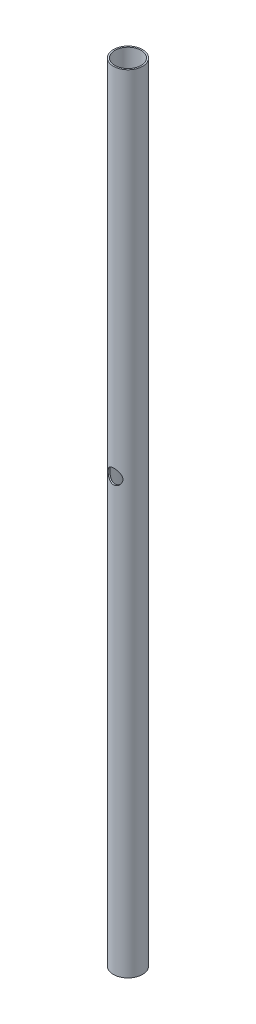
ISO-10303-21;
HEADER;
FILE_DESCRIPTION(('STEP AP214'),'2;1');
FILE_NAME('part.step','',(''),(''),'','','');
FILE_SCHEMA(('AUTOMOTIVE_DESIGN { 1 0 10303 214 1 1 1 1 }'));
ENDSEC;
DATA;
#1=APPLICATION_CONTEXT('core data for automotive mechanical design processes');
#2=APPLICATION_PROTOCOL_DEFINITION('international standard','automotive_design',2000,#1);
#3=PRODUCT_CONTEXT('',#1,'mechanical');
#4=PRODUCT('Part','Part','',(#3));
#5=PRODUCT_RELATED_PRODUCT_CATEGORY('part','',(#4));
#6=PRODUCT_DEFINITION_FORMATION('','',#4);
#7=PRODUCT_DEFINITION_CONTEXT('part definition',#1,'design');
#8=PRODUCT_DEFINITION('design','',#6,#7);
#9=PRODUCT_DEFINITION_SHAPE('','',#8);
#10=(LENGTH_UNIT() NAMED_UNIT(*) SI_UNIT(.MILLI.,.METRE.));
#11=(NAMED_UNIT(*) PLANE_ANGLE_UNIT() SI_UNIT($,.RADIAN.));
#12=(NAMED_UNIT(*) SI_UNIT($,.STERADIAN.) SOLID_ANGLE_UNIT());
#13=UNCERTAINTY_MEASURE_WITH_UNIT(LENGTH_MEASURE(1.E-05),#10,'distance_accuracy_value','');
#14=(GEOMETRIC_REPRESENTATION_CONTEXT(3) GLOBAL_UNCERTAINTY_ASSIGNED_CONTEXT((#13)) GLOBAL_UNIT_ASSIGNED_CONTEXT((#10,
#11,#12)) REPRESENTATION_CONTEXT('',''));
#15=CARTESIAN_POINT('',(0.,0.,0.));
#16=DIRECTION('',(0.,0.,1.));
#17=DIRECTION('',(1.,0.,0.));
#18=AXIS2_PLACEMENT_3D('',#15,#16,#17);
#19=CARTESIAN_POINT('',(0.,27.,0.));
#20=DIRECTION('',(0.,1.,0.));
#21=DIRECTION('',(0.,0.,1.));
#22=AXIS2_PLACEMENT_3D('',#19,#20,#21);
#23=PLANE('',#22);
#24=CARTESIAN_POINT('',(0.,27.,0.));
#25=DIRECTION('',(0.,1.,0.));
#26=DIRECTION('',(0.,0.,1.));
#27=AXIS2_PLACEMENT_3D('',#24,#25,#26);
#28=CIRCLE('',#27,0.5);
#29=CARTESIAN_POINT('',(0.,27.,0.5));
#30=VERTEX_POINT('',#29);
#31=EDGE_CURVE('E10',#30,#30,#28,.T.);
#32=ORIENTED_EDGE('',*,*,#31,.T.);
#33=EDGE_LOOP('',(#32));
#34=FACE_BOUND('',#33,.T.);
#35=CARTESIAN_POINT('',(0.,27.,0.));
#36=DIRECTION('',(0.,1.,0.));
#37=DIRECTION('',(0.,0.,1.));
#38=AXIS2_PLACEMENT_3D('',#35,#36,#37);
#39=CIRCLE('',#38,0.45);
#40=CARTESIAN_POINT('',(0.,27.,0.45));
#41=VERTEX_POINT('',#40);
#42=EDGE_CURVE('E51',#41,#41,#39,.T.);
#43=ORIENTED_EDGE('',*,*,#42,.F.);
#44=EDGE_LOOP('',(#43));
#45=FACE_BOUND('',#44,.T.);
#46=ADVANCED_FACE('F33',(#34,#45),#23,.T.);
#47=CARTESIAN_POINT('',(0.,0.,0.));
#48=DIRECTION('',(0.,1.,0.));
#49=DIRECTION('',(0.,0.,1.));
#50=AXIS2_PLACEMENT_3D('',#47,#48,#49);
#51=PLANE('',#50);
#52=CARTESIAN_POINT('',(0.,0.,0.));
#53=DIRECTION('',(0.,1.,0.));
#54=DIRECTION('',(0.,0.,1.));
#55=AXIS2_PLACEMENT_3D('',#52,#53,#54);
#56=CIRCLE('',#55,0.5);
#57=CARTESIAN_POINT('',(0.,0.,0.5));
#58=VERTEX_POINT('',#57);
#59=EDGE_CURVE('E46',#58,#58,#56,.T.);
#60=ORIENTED_EDGE('',*,*,#59,.F.);
#61=EDGE_LOOP('',(#60));
#62=FACE_BOUND('',#61,.T.);
#63=CARTESIAN_POINT('',(0.,0.,0.));
#64=DIRECTION('',(0.,1.,0.));
#65=DIRECTION('',(0.,0.,1.));
#66=AXIS2_PLACEMENT_3D('',#63,#64,#65);
#67=CIRCLE('',#66,0.45);
#68=CARTESIAN_POINT('',(0.,0.,0.45));
#69=VERTEX_POINT('',#68);
#70=EDGE_CURVE('E54',#69,#69,#67,.T.);
#71=ORIENTED_EDGE('',*,*,#70,.T.);
#72=EDGE_LOOP('',(#71));
#73=FACE_BOUND('',#72,.T.);
#74=ADVANCED_FACE('F87',(#62,#73),#51,.F.);
#75=CARTESIAN_POINT('',(0.,27.,0.));
#76=DIRECTION('',(0.,-1.,0.));
#77=DIRECTION('',(0.,0.,-1.));
#78=AXIS2_PLACEMENT_3D('',#75,#76,#77);
#79=CYLINDRICAL_SURFACE('',#78,0.5);
#80=CARTESIAN_POINT('',(0.,15.0599260781396,-0.5));
#81=CARTESIAN_POINT('',(-0.0130687405971079,15.0602431086734,-0.499999284397319));
#82=CARTESIAN_POINT('',(-0.0261776018533731,15.0595314674071,-0.499482183346041));
#83=CARTESIAN_POINT('',(-0.0520590129046771,15.0560787456185,-0.497452636192285));
#84=CARTESIAN_POINT('',(-0.0648309223805699,15.053334054152,-0.49593841962325));
#85=CARTESIAN_POINT('',(-0.0896239120042474,15.0459501821895,-0.49206143155771));
#86=CARTESIAN_POINT('',(-0.101647532498621,15.0413178658077,-0.489701738246784));
#87=CARTESIAN_POINT('',(-0.12471712373678,15.0303318529036,-0.484340890382829));
#88=CARTESIAN_POINT('',(-0.135763151760689,15.0239782573249,-0.481339773448));
#89=CARTESIAN_POINT('',(-0.157275681558225,15.0093238905417,-0.474760969070735));
#90=CARTESIAN_POINT('',(-0.167673611030449,15.000933005914,-0.471160212425725));
#91=CARTESIAN_POINT('',(-0.186981585823429,14.9826214165534,-0.463836948870498));
#92=CARTESIAN_POINT('',(-0.19589052768106,14.9726995876444,-0.460114354089743));
#93=CARTESIAN_POINT('',(-0.212731477233477,14.9506137933225,-0.452589658046664));
#94=CARTESIAN_POINT('',(-0.220518037368855,14.9383313756371,-0.448807260495963));
#95=CARTESIAN_POINT('',(-0.233905777593569,14.9124382860135,-0.441978345828607));
#96=CARTESIAN_POINT('',(-0.239508047766033,14.8988282808666,-0.438931461939311));
#97=CARTESIAN_POINT('',(-0.248076109685941,14.8712894195727,-0.434144545782209));
#98=CARTESIAN_POINT('',(-0.251152512968562,14.8574049147717,-0.432350270726179));
#99=CARTESIAN_POINT('',(-0.254913315477513,14.8292140818069,-0.430144585100165));
#100=CARTESIAN_POINT('',(-0.255600464716143,14.8149082577257,-0.429731584714976));
#101=CARTESIAN_POINT('',(-0.254611220001515,14.7881919769786,-0.430317341582915));
#102=CARTESIAN_POINT('',(-0.253216764385989,14.7757660285644,-0.43114773471273));
#103=CARTESIAN_POINT('',(-0.248635294144277,14.7513598579255,-0.433805739197923));
#104=CARTESIAN_POINT('',(-0.245447741774136,14.7393797705627,-0.435633649700639));
#105=CARTESIAN_POINT('',(-0.237378497741717,14.7160583735207,-0.440082526015176));
#106=CARTESIAN_POINT('',(-0.232483606885439,14.704722865132,-0.442709649591787));
#107=CARTESIAN_POINT('',(-0.221153671196261,14.6829927528248,-0.448476761823108));
#108=CARTESIAN_POINT('',(-0.214717993430506,14.6725985380007,-0.45161696107307));
#109=CARTESIAN_POINT('',(-0.199547388299089,14.6516698856591,-0.458539688367242));
#110=CARTESIAN_POINT('',(-0.190625434188534,14.6412809660477,-0.462353404796399));
#111=CARTESIAN_POINT('',(-0.171180155602426,14.6220836764971,-0.469900163352473));
#112=CARTESIAN_POINT('',(-0.160655960127447,14.6132761719459,-0.473633160331017));
#113=CARTESIAN_POINT('',(-0.137535812208262,14.59699057975,-0.480873056799112));
#114=CARTESIAN_POINT('',(-0.124854439719656,14.5896210778275,-0.484353765100492));
#115=CARTESIAN_POINT('',(-0.0982202352461421,14.5771771172148,-0.490447594237901));
#116=CARTESIAN_POINT('',(-0.0842683228424406,14.5721010142424,-0.493061336298128));
#117=CARTESIAN_POINT('',(-0.0566087674253749,14.5647797816459,-0.496966359714166));
#118=CARTESIAN_POINT('',(-0.0429622526949473,14.5623498028946,-0.498342608405552));
#119=CARTESIAN_POINT('',(-0.0153912241485817,14.5597902962006,-0.499953375844379));
#120=CARTESIAN_POINT('',(-0.00146686832960867,14.5596594961443,-0.500188525898676));
#121=CARTESIAN_POINT('',(0.0250154405869219,14.5616154303193,-0.499534805532417));
#122=CARTESIAN_POINT('',(0.0375900062404483,14.5635170066196,-0.498738598759838));
#123=CARTESIAN_POINT('',(0.0622251223147617,14.5691666499727,-0.496267401288213));
#124=CARTESIAN_POINT('',(0.0742856281507444,14.5729148768343,-0.494592334531973));
#125=CARTESIAN_POINT('',(0.0978262976398352,14.5822022385959,-0.490485094588233));
#126=CARTESIAN_POINT('',(0.109291023999279,14.5877741379572,-0.488039103084186));
#127=CARTESIAN_POINT('',(0.131160676953078,14.6005114978656,-0.482622001350253));
#128=CARTESIAN_POINT('',(0.141565197808523,14.6076775651835,-0.479650691262711));
#129=CARTESIAN_POINT('',(0.162081052561194,14.6241918003976,-0.473134658613066));
#130=CARTESIAN_POINT('',(0.172068241865524,14.6336834463642,-0.469562271913127));
#131=CARTESIAN_POINT('',(0.190372307490366,14.6541803463061,-0.462444621157885));
#132=CARTESIAN_POINT('',(0.198687931339629,14.6651867249158,-0.458899379340722));
#133=CARTESIAN_POINT('',(0.213880685542216,14.6891963253733,-0.452027275527825));
#134=CARTESIAN_POINT('',(0.220645142265048,14.7022787146691,-0.448725338160548));
#135=CARTESIAN_POINT('',(0.231807767227097,14.7296034700236,-0.443062957206013));
#136=CARTESIAN_POINT('',(0.236208628749406,14.7438444944266,-0.440701442817151));
#137=CARTESIAN_POINT('',(0.24213886158658,14.7717942034951,-0.437469235890071));
#138=CARTESIAN_POINT('',(0.243881351049397,14.7854444976997,-0.436488455674465));
#139=CARTESIAN_POINT('',(0.245078780899116,14.8128733826924,-0.435817677021396));
#140=CARTESIAN_POINT('',(0.244535112681578,14.8266518903535,-0.436126893468492));
#141=CARTESIAN_POINT('',(0.241375831593556,14.852410296605,-0.437881509874171));
#142=CARTESIAN_POINT('',(0.238983556257997,14.8644272464488,-0.43920431716041));
#143=CARTESIAN_POINT('',(0.232508628727898,14.8878721529293,-0.442665922435649));
#144=CARTESIAN_POINT('',(0.228425425351653,14.8992999161453,-0.444804986477113));
#145=CARTESIAN_POINT('',(0.218448447005977,14.9219340016363,-0.449792023760454));
#146=CARTESIAN_POINT('',(0.212469010563156,14.9330952579096,-0.452671969819556));
#147=CARTESIAN_POINT('',(0.198953720458618,14.9543292121428,-0.458772672692665));
#148=CARTESIAN_POINT('',(0.191417116155483,14.9644013815219,-0.461993593508934));
#149=CARTESIAN_POINT('',(0.173904547083895,14.9844837666293,-0.468888392134496));
#150=CARTESIAN_POINT('',(0.163741556883157,14.9943294860322,-0.472568647981121));
#151=CARTESIAN_POINT('',(0.141831847393414,15.0122324942431,-0.479599874340502));
#152=CARTESIAN_POINT('',(0.130084106209135,15.0202886201211,-0.482950629950936));
#153=CARTESIAN_POINT('',(0.105006585342082,15.0345044712754,-0.489022842385211));
#154=CARTESIAN_POINT('',(0.0916496490052845,15.0406226160315,-0.491730224947188));
#155=CARTESIAN_POINT('',(0.0639386696291986,15.0504555280152,-0.496091764604699));
#156=CARTESIAN_POINT('',(0.0495875723723831,15.0541770853236,-0.497748897085902));
#157=CARTESIAN_POINT('',(0.029220805356604,15.0575666430219,-0.499179413268877));
#158=CARTESIAN_POINT('',(0.0234061520878796,15.0583253029916,-0.499486031415215));
#159=CARTESIAN_POINT('',(0.0117303647929215,15.0594338408633,-0.499896490536177));
#160=CARTESIAN_POINT('',(0.0058692284592487,15.0597836983427,-0.500000321380288));
#161=CARTESIAN_POINT('',(0.,15.0599260781396,-0.5));
#162=B_SPLINE_CURVE_WITH_KNOTS('',3,(#80,#81,#82,#83,#84,#85,#86,#87,#88,#89,#90,#91,#92,#93,
#94,#95,#96,#97,#98,#99,#100,#101,#102,#103,#104,#105,#106,#107,#108,#109,#110,#111,#112,#113,
#114,#115,#116,#117,#118,#119,#120,#121,#122,#123,#124,#125,#126,#127,#128,#129,#130,#131,#132,
#133,#134,#135,#136,#137,#138,#139,#140,#141,#142,#143,#144,#145,#146,#147,#148,#149,#150,#151,
#152,#153,#154,#155,#156,#157,#158,#159,#160,#161),.UNSPECIFIED.,.T.,.F.,(4,2,2,2,2,2,2,2,2,2,2,
2,2,2,2,2,2,2,2,2,2,2,2,2,2,2,2,2,2,2,2,2,2,2,2,2,2,2,2,2,4),(0.,0.0391941285804924,
0.078458038125048,0.117580425658553,0.156700519372408,0.198043019816072,0.239416023914352,
0.284273111137494,0.329107783417861,0.371854913304272,0.414552825269421,0.451967397877446,
0.489393196982037,0.527114988421286,0.56485230209177,0.607316534500517,0.649803933997391,
0.694788956447591,0.739741674917103,0.78129946809849,0.822834267024693,0.86088377546017,
0.898936577271591,0.937714467457849,0.976507142579664,1.01902578664445,1.06157617130902,
1.10661687592344,1.15160614781602,1.19275356782435,1.23387594841877,1.27068444060148,
1.30750494048432,1.34630829837046,1.38513040545634,1.42879585446983,1.47248959608935,
1.51706567609554,1.56151489966418,1.57911627465022,1.59671852891419),.UNSPECIFIED.);
#163=CARTESIAN_POINT('',(0.,15.0599260781396,-0.5));
#164=VERTEX_POINT('',#163);
#165=EDGE_CURVE('E77',#164,#164,#162,.T.);
#166=ORIENTED_EDGE('',*,*,#165,.T.);
#167=EDGE_LOOP('',(#166));
#168=FACE_BOUND('',#167,.T.);
#169=CARTESIAN_POINT('',(-0.244716865915036,14.81,0.436020246705038));
#170=CARTESIAN_POINT('',(-0.244715942952083,14.8230269520487,0.436021370495006));
#171=CARTESIAN_POINT('',(-0.243684678332625,14.8360703528812,0.436604541424868));
#172=CARTESIAN_POINT('',(-0.239612866790929,14.8617568161693,0.438851614770198));
#173=CARTESIAN_POINT('',(-0.236568097734895,14.8743989787609,0.440517788016227));
#174=CARTESIAN_POINT('',(-0.228635304116065,14.898862916086,0.444686028977671));
#175=CARTESIAN_POINT('',(-0.223757077974553,14.9106886631184,0.447183645299049));
#176=CARTESIAN_POINT('',(-0.212328294219879,14.9333560504992,0.452721654537171));
#177=CARTESIAN_POINT('',(-0.205777646135723,14.9441976375656,0.455762076814756));
#178=CARTESIAN_POINT('',(-0.19055945822797,14.9655764321394,0.46234320640898));
#179=CARTESIAN_POINT('',(-0.181761883025495,14.9760147839184,0.465904493396259));
#180=CARTESIAN_POINT('',(-0.162575349944251,14.9953520971017,0.472941537664625));
#181=CARTESIAN_POINT('',(-0.152185603112334,15.0042502906459,0.476417251546013));
#182=CARTESIAN_POINT('',(-0.129257576651585,15.0208417877869,0.483160944236244));
#183=CARTESIAN_POINT('',(-0.116621678601655,15.0284134419649,0.486399127451026));
#184=CARTESIAN_POINT('',(-0.0900639779074238,15.0412852133114,0.492008272371214));
#185=CARTESIAN_POINT('',(-0.0761429935585672,15.0465867640343,0.494379781236262));
#186=CARTESIAN_POINT('',(-0.0484621350651418,15.0543761653253,0.497827161741565));
#187=CARTESIAN_POINT('',(-0.0347612784743517,15.0570373815889,0.498983216856711));
#188=CARTESIAN_POINT('',(-0.00706235450211816,15.0600415296688,0.500141792456026));
#189=CARTESIAN_POINT('',(0.00693552789933308,15.0603858641989,0.500145010965818));
#190=CARTESIAN_POINT('',(0.0335279980264424,15.0588133315074,0.499036700266744));
#191=CARTESIAN_POINT('',(0.0461387629377602,15.0570904961197,0.498022085991664));
#192=CARTESIAN_POINT('',(0.0708533363732864,15.0517797890238,0.49511075946072));
#193=CARTESIAN_POINT('',(0.0829571068889518,15.0481917777559,0.493213981199016));
#194=CARTESIAN_POINT('',(0.10652656883277,15.0392293584776,0.488669906116052));
#195=CARTESIAN_POINT('',(0.117981115265228,15.033830921707,0.486012588624558));
#196=CARTESIAN_POINT('',(0.139842654203611,15.0214341459496,0.480179371618958));
#197=CARTESIAN_POINT('',(0.150249269743997,15.0144352341744,0.477003286561497));
#198=CARTESIAN_POINT('',(0.170771236745675,14.9982761621168,0.470069459451907));
#199=CARTESIAN_POINT('',(0.180766068205439,14.9889742429185,0.46628511455992));
#200=CARTESIAN_POINT('',(0.199118370939751,14.9688525687675,0.458748838003601));
#201=CARTESIAN_POINT('',(0.207474582484756,14.9580316569315,0.45499693338013));
#202=CARTESIAN_POINT('',(0.222835838938524,14.934337951894,0.447684197185334));
#203=CARTESIAN_POINT('',(0.229721381135684,14.9213784942365,0.444150629942721));
#204=CARTESIAN_POINT('',(0.241173367855165,14.8942655821603,0.438038768350532));
#205=CARTESIAN_POINT('',(0.245742232326743,14.8801133917456,0.43545947794972));
#206=CARTESIAN_POINT('',(0.252063946047605,14.8521963721793,0.431828863356052));
#207=CARTESIAN_POINT('',(0.25401126030551,14.8384897202391,0.430672652135825));
#208=CARTESIAN_POINT('',(0.255622736560979,14.8108996646209,0.429718647751669));
#209=CARTESIAN_POINT('',(0.255288511337945,14.7970163927201,0.429919895023445));
#210=CARTESIAN_POINT('',(0.252524517232433,14.7710865203553,0.431547494650679));
#211=CARTESIAN_POINT('',(0.250327981433366,14.759005137223,0.43283742333399));
#212=CARTESIAN_POINT('',(0.244246719683059,14.7354080534323,0.436297701413095));
#213=CARTESIAN_POINT('',(0.240361447017709,14.7238925373134,0.43846833591471));
#214=CARTESIAN_POINT('',(0.23082193452706,14.7011471672743,0.443566961274142));
#215=CARTESIAN_POINT('',(0.22509409889986,14.6899552457866,0.446525373029258));
#216=CARTESIAN_POINT('',(0.212093224528166,14.6686326821153,0.452845098028661));
#217=CARTESIAN_POINT('',(0.204819392006984,14.6585025891217,0.45620661785691));
#218=CARTESIAN_POINT('',(0.187858141585737,14.6382553081191,0.463470235790315));
#219=CARTESIAN_POINT('',(0.177982059454874,14.6283007123206,0.467387062438497));
#220=CARTESIAN_POINT('',(0.156637437031202,14.6101469405016,0.474966264423839));
#221=CARTESIAN_POINT('',(0.145168360972829,14.6019483574424,0.478628553528988));
#222=CARTESIAN_POINT('',(0.120544629408133,14.5873565685125,0.485423677778974));
#223=CARTESIAN_POINT('',(0.107353476892316,14.5810167204473,0.488539988759549));
#224=CARTESIAN_POINT('',(0.0798898946186159,14.5707155240357,0.493773566577013));
#225=CARTESIAN_POINT('',(0.0656184267681912,14.5667520871584,0.495891710310835));
#226=CARTESIAN_POINT('',(0.0378115686785371,14.5616578589563,0.498745913922281));
#227=CARTESIAN_POINT('',(0.0243287866408655,14.560300531031,0.499590952078439));
#228=CARTESIAN_POINT('',(-0.00270046610563288,14.5597891836364,0.500175128524599));
#229=CARTESIAN_POINT('',(-0.0162469128616101,14.560634392869,0.499914653929809));
#230=CARTESIAN_POINT('',(-0.0420781630001115,14.564354101699,0.498383354218001));
#231=CARTESIAN_POINT('',(-0.0543872819322376,14.5670912123147,0.497180236615696));
#232=CARTESIAN_POINT('',(-0.078361499570664,14.5743317498254,0.49396948014967));
#233=CARTESIAN_POINT('',(-0.0900265056462803,14.5788354300222,0.491961725911214));
#234=CARTESIAN_POINT('',(-0.112940431948721,14.5896817630427,0.487223991913943));
#235=CARTESIAN_POINT('',(-0.124150217178105,14.5960948308066,0.484466795095176));
#236=CARTESIAN_POINT('',(-0.145386423317697,14.6104894827102,0.478523339663796));
#237=CARTESIAN_POINT('',(-0.155412297316372,14.6184717872617,0.475336884197591));
#238=CARTESIAN_POINT('',(-0.175045511701491,14.6366992847748,0.468484391683393));
#239=CARTESIAN_POINT('',(-0.184511900569301,14.6470906219437,0.464802186096707));
#240=CARTESIAN_POINT('',(-0.201616610664722,14.6693626803578,0.457642812314984));
#241=CARTESIAN_POINT('',(-0.209253314578199,14.6812447052377,0.454165827551559));
#242=CARTESIAN_POINT('',(-0.222680521979577,14.7066591616246,0.447739501844859));
#243=CARTESIAN_POINT('',(-0.228405055397563,14.7202318827768,0.444810307845728));
#244=CARTESIAN_POINT('',(-0.23738659218561,14.7483331010903,0.440084113098745));
#245=CARTESIAN_POINT('',(-0.240651848237286,14.762858222229,0.438283329156019));
#246=CARTESIAN_POINT('',(-0.243298867995101,14.7829513389127,0.436813544646584));
#247=CARTESIAN_POINT('',(-0.24382978551811,14.7883419735994,0.436517118748629));
#248=CARTESIAN_POINT('',(-0.244538988432109,14.7991541201706,0.436120229252511));
#249=CARTESIAN_POINT('',(-0.244717250232776,14.8045756340965,0.436019778763807));
#250=CARTESIAN_POINT('',(-0.244716865915036,14.81,0.436020246705038));
#251=B_SPLINE_CURVE_WITH_KNOTS('',3,(#169,#170,#171,#172,#173,#174,#175,#176,#177,#178,#179,
#180,#181,#182,#183,#184,#185,#186,#187,#188,#189,#190,#191,#192,#193,#194,#195,#196,#197,#198,
#199,#200,#201,#202,#203,#204,#205,#206,#207,#208,#209,#210,#211,#212,#213,#214,#215,#216,#217,
#218,#219,#220,#221,#222,#223,#224,#225,#226,#227,#228,#229,#230,#231,#232,#233,#234,#235,#236,
#237,#238,#239,#240,#241,#242,#243,#244,#245,#246,#247,#248,#249,#250),.UNSPECIFIED.,.T.,.F.,(4,
2,2,2,2,2,2,2,2,2,2,2,2,2,2,2,2,2,2,2,2,2,2,2,2,2,2,2,2,2,2,2,2,2,2,2,2,2,2,2,4),(0.,
0.0390580306486792,0.0781982232062012,0.117132148979721,0.156068181361287,0.198215578124558,
0.240383927710928,0.285394730596909,0.330377067409728,0.372158712419838,0.4139150592151,
0.452040243711345,0.490168281293638,0.528823836827866,0.567493248375679,0.609817978642225,
0.652175120614797,0.697222104323622,0.742221935529263,0.783655727135528,0.825060232970931,
0.861935458560063,0.898822631090158,0.937418241015221,0.97603371555012,1.01951685895154,
1.06301466244551,1.10766045353242,1.15226694952193,1.19278067597372,1.23328021698493,
1.27111106217873,1.30894733378003,1.34840187679868,1.3878745752518,1.4312756046261,
1.47471485711113,1.51952687259475,1.56418783250514,1.58045033796152,1.5967139312346),.UNSPECIFIED.);
#252=CARTESIAN_POINT('',(-0.244716865915036,14.81,0.436020246705038));
#253=VERTEX_POINT('',#252);
#254=EDGE_CURVE('E73',#253,#253,#251,.T.);
#255=ORIENTED_EDGE('',*,*,#254,.T.);
#256=EDGE_LOOP('',(#255));
#257=FACE_BOUND('',#256,.T.);
#258=ORIENTED_EDGE('',*,*,#31,.F.);
#259=EDGE_LOOP('',(#258));
#260=FACE_BOUND('',#259,.T.);
#261=ORIENTED_EDGE('',*,*,#59,.T.);
#262=EDGE_LOOP('',(#261));
#263=FACE_BOUND('',#262,.T.);
#264=ADVANCED_FACE('F35',(#168,#257,#260,#263),#79,.T.);
#265=CARTESIAN_POINT('',(0.,27.,0.));
#266=DIRECTION('',(0.,-1.,0.));
#267=DIRECTION('',(0.,0.,-1.));
#268=AXIS2_PLACEMENT_3D('',#265,#266,#267);
#269=CYLINDRICAL_SURFACE('',#268,0.45);
#270=CARTESIAN_POINT('',(0.,15.0599401249754,-0.45));
#271=CARTESIAN_POINT('',(-0.0128984394084565,15.0602229980953,-0.450000479050531));
#272=CARTESIAN_POINT('',(-0.0258158294129288,15.0595023482999,-0.449440828655682));
#273=CARTESIAN_POINT('',(-0.0512942044087638,15.0560955432755,-0.447249777234769));
#274=CARTESIAN_POINT('',(-0.063855168468018,15.0534092728571,-0.445618313398801));
#275=CARTESIAN_POINT('',(-0.0882283213538681,15.0462134121841,-0.441438963389266));
#276=CARTESIAN_POINT('',(-0.100042888827551,15.0417099912807,-0.438894181194271));
#277=CARTESIAN_POINT('',(-0.122714237264954,15.0310561226835,-0.433103102568131));
#278=CARTESIAN_POINT('',(-0.133570769886339,15.0249052495938,-0.429856624990995));
#279=CARTESIAN_POINT('',(-0.154817465653528,15.010685685497,-0.422688229888939));
#280=CARTESIAN_POINT('',(-0.165130982968042,15.0025180488274,-0.418736062943716));
#281=CARTESIAN_POINT('',(-0.184317696497799,14.9846999519432,-0.410652640252605));
#282=CARTESIAN_POINT('',(-0.193189481391042,14.9750480565478,-0.406521213980221));
#283=CARTESIAN_POINT('',(-0.210216886692234,14.9533105423901,-0.398006119213953));
#284=CARTESIAN_POINT('',(-0.218192547540669,14.9410747772635,-0.393643186971586));
#285=CARTESIAN_POINT('',(-0.231964520764578,14.9152065906746,-0.385688971419343));
#286=CARTESIAN_POINT('',(-0.237763438194111,14.9015758636915,-0.382096767947955));
#287=CARTESIAN_POINT('',(-0.245999845333308,14.8760895384401,-0.376832890265223));
#288=CARTESIAN_POINT('',(-0.248878294808788,14.8644263828742,-0.374920505790739));
#289=CARTESIAN_POINT('',(-0.25294450946747,14.840688528813,-0.372189843862363));
#290=CARTESIAN_POINT('',(-0.25413408896539,14.8286142862449,-0.371370392352795));
#291=CARTESIAN_POINT('',(-0.254759940122677,14.8043754813961,-0.370941447314124));
#292=CARTESIAN_POINT('',(-0.254192918753097,14.7922107921787,-0.371334226299552));
#293=CARTESIAN_POINT('',(-0.25133146014893,14.7681788374661,-0.373276478800635));
#294=CARTESIAN_POINT('',(-0.249036009140329,14.7563117507459,-0.374826631144756));
#295=CARTESIAN_POINT('',(-0.242882958258783,14.7333730411858,-0.378841558635644));
#296=CARTESIAN_POINT('',(-0.239051313723061,14.7222916346606,-0.381291082887192));
#297=CARTESIAN_POINT('',(-0.229962829728809,14.7009071462764,-0.386840242650974));
#298=CARTESIAN_POINT('',(-0.224705461677163,14.6906043549075,-0.389940119187428));
#299=CARTESIAN_POINT('',(-0.212032102465392,14.6694798190717,-0.396991405562111));
#300=CARTESIAN_POINT('',(-0.204413797047065,14.6587988604572,-0.401001123847089));
#301=CARTESIAN_POINT('',(-0.187620506559373,14.638777370917,-0.409127943073518));
#302=CARTESIAN_POINT('',(-0.178444269064577,14.6294379296802,-0.413245128136352));
#303=CARTESIAN_POINT('',(-0.15753777271593,14.6112828216585,-0.421690507839207));
#304=CARTESIAN_POINT('',(-0.145635374180525,14.6026496106669,-0.425988874423069));
#305=CARTESIAN_POINT('',(-0.12030357379514,14.5875395405772,-0.433823009843068));
#306=CARTESIAN_POINT('',(-0.10687493269729,14.5810616134518,-0.437359156082277));
#307=CARTESIAN_POINT('',(-0.0796555124959961,14.5708668577298,-0.443099300639006));
#308=CARTESIAN_POINT('',(-0.0659307878745748,14.5670118064964,-0.445368608605502));
#309=CARTESIAN_POINT('',(-0.0378813209184581,14.5617010374426,-0.448624147193542));
#310=CARTESIAN_POINT('',(-0.0235571785107598,14.5602429768292,-0.449611630457854));
#311=CARTESIAN_POINT('',(0.00346184394570258,14.5598380624066,-0.45016550784262));
#312=CARTESIAN_POINT('',(0.0161504257693592,14.5606163047864,-0.449885228600454));
#313=CARTESIAN_POINT('',(0.0411986626512604,14.5640657259016,-0.448285736232218));
#314=CARTESIAN_POINT('',(0.0535583205011474,14.566736888566,-0.446966531926619));
#315=CARTESIAN_POINT('',(0.0774254359344494,14.5737917280194,-0.443450945749376));
#316=CARTESIAN_POINT('',(0.0889432239922978,14.5781478697425,-0.441268655714151));
#317=CARTESIAN_POINT('',(0.111098895205677,14.5884128314464,-0.436218182155493));
#318=CARTESIAN_POINT('',(0.121736570244254,14.5943220172976,-0.433349837023605));
#319=CARTESIAN_POINT('',(0.142941311816325,14.6081709702786,-0.426851690124986));
#320=CARTESIAN_POINT('',(0.153401557062174,14.6162520555032,-0.423175026633223));
#321=CARTESIAN_POINT('',(0.172897932659432,14.633902373881,-0.415591116940912));
#322=CARTESIAN_POINT('',(0.18193254022033,14.6434731768919,-0.411683630226496));
#323=CARTESIAN_POINT('',(0.199308859997474,14.6650417735822,-0.403580701199023));
#324=CARTESIAN_POINT('',(0.207471921020744,14.6771898322722,-0.399399409024842));
#325=CARTESIAN_POINT('',(0.22161924463976,14.7028903767692,-0.391726858335009));
#326=CARTESIAN_POINT('',(0.227606018376917,14.7164412205967,-0.388234806669986));
#327=CARTESIAN_POINT('',(0.236186393336413,14.7418454359263,-0.383061343630769));
#328=CARTESIAN_POINT('',(0.239216470527157,14.7535060372111,-0.381158607248781));
#329=CARTESIAN_POINT('',(0.243557055662442,14.7772591566803,-0.378400293496536));
#330=CARTESIAN_POINT('',(0.24486943703057,14.7893511895022,-0.377543575343764));
#331=CARTESIAN_POINT('',(0.245703864912188,14.8136497624975,-0.377001211697832));
#332=CARTESIAN_POINT('',(0.245222142568735,14.8258564899299,-0.377318031437195));
#333=CARTESIAN_POINT('',(0.24248897438985,14.8499888817259,-0.379079923492943));
#334=CARTESIAN_POINT('',(0.240236532155311,14.861914383949,-0.380525631041001));
#335=CARTESIAN_POINT('',(0.234144511868688,14.8849227062589,-0.384302872886247));
#336=CARTESIAN_POINT('',(0.2303391889431,14.8960179496723,-0.386615205567036));
#337=CARTESIAN_POINT('',(0.221286214171404,14.9174412842632,-0.391866968466637));
#338=CARTESIAN_POINT('',(0.21603803270821,14.9277690919735,-0.394806628864145));
#339=CARTESIAN_POINT('',(0.203387801388966,14.9489334275022,-0.40148655838814));
#340=CARTESIAN_POINT('',(0.195785496447964,14.9596330991629,-0.405281226371706));
#341=CARTESIAN_POINT('',(0.179027148516503,14.979710477181,-0.412958030469403));
#342=CARTESIAN_POINT('',(0.16986985759415,14.9890871105989,-0.416840234647129));
#343=CARTESIAN_POINT('',(0.148978839942063,15.0073744501548,-0.424787364732618));
#344=CARTESIAN_POINT('',(0.137068585688295,15.0160995248455,-0.428819770860701));
#345=CARTESIAN_POINT('',(0.11172791774839,15.0314125561561,-0.436108145318829));
#346=CARTESIAN_POINT('',(0.0982981696317233,15.0380014436187,-0.43936445166972));
#347=CARTESIAN_POINT('',(0.07097990974078,15.0484704529239,-0.444573026897851));
#348=CARTESIAN_POINT('',(0.0571488757705993,15.0524706327889,-0.446582878044056));
#349=CARTESIAN_POINT('',(0.0288860915765994,15.0580457731449,-0.449295453967212));
#350=CARTESIAN_POINT('',(0.0144549459122241,15.0596231164197,-0.449999463140517));
#351=CARTESIAN_POINT('',(0.,15.0599401249754,-0.45));
#352=B_SPLINE_CURVE_WITH_KNOTS('',3,(#270,#271,#272,#273,#274,#275,#276,#277,#278,#279,#280,
#281,#282,#283,#284,#285,#286,#287,#288,#289,#290,#291,#292,#293,#294,#295,#296,#297,#298,#299,
#300,#301,#302,#303,#304,#305,#306,#307,#308,#309,#310,#311,#312,#313,#314,#315,#316,#317,#318,
#319,#320,#321,#322,#323,#324,#325,#326,#327,#328,#329,#330,#331,#332,#333,#334,#335,#336,#337,
#338,#339,#340,#341,#342,#343,#344,#345,#346,#347,#348,#349,#350,#351),.UNSPECIFIED.,.T.,.F.,(4,
2,2,2,2,2,2,2,2,2,2,2,2,2,2,2,2,2,2,2,2,2,2,2,2,2,2,2,2,2,2,2,2,2,2,2,2,2,2,2,4),(0.,
0.0386494876471066,0.0773012404151902,0.115822857350995,0.154354430727852,0.195400043106253,
0.236485596391798,0.281994847546706,0.327449459773885,0.363785530223462,0.400082536042776,
0.436447627546476,0.472834064859341,0.508630016774494,0.544439258379841,0.585432388156784,
0.626458629817969,0.672183011102608,0.71788470030796,0.760938632051097,0.803950458271935,
0.841909042278608,0.879867304020515,0.917229828574523,0.954601162999551,0.99559545677141,
1.03663324631911,1.0820788404402,1.12747182877906,1.16390649394701,1.20030138804675,
1.23677277964283,1.27326470870321,1.30899178400431,1.34473199087046,1.38555973830209,
1.42642040767093,1.47210403587423,1.51776773061817,1.56112387398864,1.60443735058704),.UNSPECIFIED.);
#353=CARTESIAN_POINT('',(0.,15.0599401249754,-0.45));
#354=VERTEX_POINT('',#353);
#355=EDGE_CURVE('E38',#354,#354,#352,.T.);
#356=ORIENTED_EDGE('',*,*,#355,.F.);
#357=EDGE_LOOP('',(#356));
#358=FACE_BOUND('',#357,.T.);
#359=CARTESIAN_POINT('',(-0.245432339149769,14.81,0.377177633084828));
#360=CARTESIAN_POINT('',(-0.245431361069559,14.8227871176228,0.377178977599821));
#361=CARTESIAN_POINT('',(-0.244436407740362,14.8355847975123,0.377831492413685));
#362=CARTESIAN_POINT('',(-0.240517348905763,14.8607678952919,0.380337257030957));
#363=CARTESIAN_POINT('',(-0.237590071813748,14.8731526001858,0.38219248079031));
#364=CARTESIAN_POINT('',(-0.229986558371585,14.8970945367559,0.386814735295975));
#365=CARTESIAN_POINT('',(-0.225321428449369,14.9086564793591,0.389575962791189));
#366=CARTESIAN_POINT('',(-0.214411604959933,14.9308345933192,0.395685051157635));
#367=CARTESIAN_POINT('',(-0.208166560548146,14.9414505538972,0.399033042278045));
#368=CARTESIAN_POINT('',(-0.193523637628998,14.9626416736362,0.406352336749199));
#369=CARTESIAN_POINT('',(-0.18497002007506,14.9730993583615,0.410352302884484));
#370=CARTESIAN_POINT('',(-0.16628057087848,14.9925346324862,0.418274888657935));
#371=CARTESIAN_POINT('',(-0.156143777653185,15.0015113155021,0.422197459646498));
#372=CARTESIAN_POINT('',(-0.133492611241132,15.0185089834289,0.429924447909582));
#373=CARTESIAN_POINT('',(-0.120847436002416,15.0263760330422,0.433687989712499));
#374=CARTESIAN_POINT('',(-0.0941651411871626,15.0398241662657,0.440251134324123));
#375=CARTESIAN_POINT('',(-0.0801291143736553,15.0454070271013,0.443051486276482));
#376=CARTESIAN_POINT('',(-0.0523215752800168,15.0536305689123,0.447149809620181));
#377=CARTESIAN_POINT('',(-0.0386279950472455,15.056480060588,0.44855476760502));
#378=CARTESIAN_POINT('',(-0.0108903119980291,15.0598534484803,0.450081943248999));
#379=CARTESIAN_POINT('',(0.00315350990032688,15.0603791518049,0.450205157764576));
#380=CARTESIAN_POINT('',(0.0295815473613546,15.0591476513371,0.449200496565673));
#381=CARTESIAN_POINT('',(0.0419828508477954,15.0576282184693,0.448204805208525));
#382=CARTESIAN_POINT('',(0.066309066141714,15.0527890962334,0.445256363911731));
#383=CARTESIAN_POINT('',(0.0782339411510421,15.0494692680947,0.443303540199525));
#384=CARTESIAN_POINT('',(0.101437799168277,15.0411266624052,0.438579719650125));
#385=CARTESIAN_POINT('',(0.112708854706976,15.036086678947,0.435800494367005));
#386=CARTESIAN_POINT('',(0.134258788143235,15.024483690121,0.429651401179315));
#387=CARTESIAN_POINT('',(0.144537352942764,15.0179202063475,0.426281347825926));
#388=CARTESIAN_POINT('',(0.165013726075272,15.0026408541592,0.418810004950491));
#389=CARTESIAN_POINT('',(0.175080051115009,14.9937681827074,0.414669051316108));
#390=CARTESIAN_POINT('',(0.193658324837311,14.9745323867858,0.406325474063595));
#391=CARTESIAN_POINT('',(0.202168608380412,14.9641676866242,0.402122789520351));
#392=CARTESIAN_POINT('',(0.218168679612168,14.9411111427216,0.393689482183752));
#393=CARTESIAN_POINT('',(0.225495828968053,14.9282934800373,0.389490918667822));
#394=CARTESIAN_POINT('',(0.23785291512962,14.9013352549748,0.382071095068607));
#395=CARTESIAN_POINT('',(0.242885513649007,14.8871962484454,0.378848704074712));
#396=CARTESIAN_POINT('',(0.250077597987799,14.8591620844995,0.374136982452191));
#397=CARTESIAN_POINT('',(0.252435668033021,14.8453388340184,0.372529074663282));
#398=CARTESIAN_POINT('',(0.254810185708288,14.8174065882224,0.370909990036851));
#399=CARTESIAN_POINT('',(0.254829464846502,14.8032979591158,0.370896882419698));
#400=CARTESIAN_POINT('',(0.252707218813505,14.7774699227844,0.372343822569601));
#401=CARTESIAN_POINT('',(0.250888844295749,14.7657091186401,0.373583557522589));
#402=CARTESIAN_POINT('',(0.245661659074671,14.7426962025083,0.377041247294436));
#403=CARTESIAN_POINT('',(0.242252121695644,14.7314443255232,0.379259649039928));
#404=CARTESIAN_POINT('',(0.233803535856426,14.7092251468059,0.384527648892926));
#405=CARTESIAN_POINT('',(0.228703075298013,14.6982887262529,0.387607757325713));
#406=CARTESIAN_POINT('',(0.21706526588425,14.6773676043752,0.394242986749254));
#407=CARTESIAN_POINT('',(0.210527215655214,14.6673833710261,0.397798339269775));
#408=CARTESIAN_POINT('',(0.194963631532731,14.6469508771013,0.405680873272607));
#409=CARTESIAN_POINT('',(0.185706599885104,14.6366903012198,0.41003967019885));
#410=CARTESIAN_POINT('',(0.165572261933711,14.6178000804128,0.41857553698377));
#411=CARTESIAN_POINT('',(0.154693961758577,14.609171443314,0.422752493326607));
#412=CARTESIAN_POINT('',(0.130872758968661,14.5933567010985,0.430741534795218));
#413=CARTESIAN_POINT('',(0.117850262871902,14.5862731910974,0.434521895839569));
#414=CARTESIAN_POINT('',(0.0905289489325579,14.574480369963,0.441022566556162));
#415=CARTESIAN_POINT('',(0.0762314970280559,14.569768553024,0.443743994348311));
#416=CARTESIAN_POINT('',(0.0483445201337782,14.5633352216962,0.447593820740998));
#417=CARTESIAN_POINT('',(0.0348331376189959,14.5613562573136,0.448857141644744));
#418=CARTESIAN_POINT('',(0.00761258134425626,14.5596377603041,0.450141390817991));
#419=CARTESIAN_POINT('',(-0.00609647925770371,14.5598969935836,0.450163003687956));
#420=CARTESIAN_POINT('',(-0.0319766860287023,14.5625085612383,0.44903214397611));
#421=CARTESIAN_POINT('',(-0.0441731132398597,14.5646657596096,0.447987710133894));
#422=CARTESIAN_POINT('',(-0.0680114283666588,14.5707077763255,0.444993044777569));
#423=CARTESIAN_POINT('',(-0.0796532512060476,14.5745927968596,0.443042707253616));
#424=CARTESIAN_POINT('',(-0.102493008256974,14.5840943700223,0.438332859715611));
#425=CARTESIAN_POINT('',(-0.113663793728657,14.5897636160079,0.435548870759171));
#426=CARTESIAN_POINT('',(-0.134937725584142,14.6026065241749,0.42943510873698));
#427=CARTESIAN_POINT('',(-0.145040448839352,14.6097807792538,0.426105120688413));
#428=CARTESIAN_POINT('',(-0.165138743191819,14.6263862048686,0.418755956042826));
#429=CARTESIAN_POINT('',(-0.17498491704526,14.6359828870067,0.414701677290829));
#430=CARTESIAN_POINT('',(-0.193003872381087,14.6566706735639,0.406629104580754));
#431=CARTESIAN_POINT('',(-0.201174553133414,14.6677636254779,0.402610861764834));
#432=CARTESIAN_POINT('',(-0.216160021749967,14.6920956824588,0.394779996787626));
#433=CARTESIAN_POINT('',(-0.222838132999879,14.7054310665445,0.391001989117459));
#434=CARTESIAN_POINT('',(-0.233750949898721,14.733301229597,0.384579344174671));
#435=CARTESIAN_POINT('',(-0.237993349637214,14.7478320641325,0.381931144874044));
#436=CARTESIAN_POINT('',(-0.242388602991163,14.7704614853542,0.379144653419006));
#437=CARTESIAN_POINT('',(-0.243526971497926,14.7783063250158,0.378411724249191));
#438=CARTESIAN_POINT('',(-0.245049123803881,14.7940994184097,0.37742780871903));
#439=CARTESIAN_POINT('',(-0.245432947419754,14.802047666663,0.377176796928336));
#440=CARTESIAN_POINT('',(-0.245432339149769,14.81,0.377177633084828));
#441=B_SPLINE_CURVE_WITH_KNOTS('',3,(#359,#360,#361,#362,#363,#364,#365,#366,#367,#368,#369,
#370,#371,#372,#373,#374,#375,#376,#377,#378,#379,#380,#381,#382,#383,#384,#385,#386,#387,#388,
#389,#390,#391,#392,#393,#394,#395,#396,#397,#398,#399,#400,#401,#402,#403,#404,#405,#406,#407,
#408,#409,#410,#411,#412,#413,#414,#415,#416,#417,#418,#419,#420,#421,#422,#423,#424,#425,#426,
#427,#428,#429,#430,#431,#432,#433,#434,#435,#436,#437,#438,#439,#440),.UNSPECIFIED.,.T.,.F.,(4,
2,2,2,2,2,2,2,2,2,2,2,2,2,2,2,2,2,2,2,2,2,2,2,2,2,2,2,2,2,2,2,2,2,2,2,2,2,2,2,4),(0.,
0.0383275383121314,0.0767181418165743,0.114867490734353,0.15302531875558,0.195124472953972,
0.237249297320685,0.283086394105052,0.32888775895821,0.370817544321698,0.412714716993645,
0.450138183779182,0.487564535494062,0.525376784579264,0.563200923472863,0.605157027584198,
0.64715776998092,0.692969119547479,0.738727191197928,0.780803708727071,0.822829284894512,
0.858561481419957,0.894310012645047,0.931533072864822,0.968774333989568,1.01205983472219,
1.05537198035082,1.1010145353775,1.14660876512922,1.18751950208838,1.22840768319894,
1.26552695983852,1.30265058131133,1.34099383799076,1.37935222843905,1.42217621152691,
1.46505356330605,1.51096189856281,1.55672440609146,1.5805616346679,1.60439760534061),.UNSPECIFIED.);
#442=CARTESIAN_POINT('',(-0.245432339149769,14.81,0.377177633084828));
#443=VERTEX_POINT('',#442);
#444=EDGE_CURVE('E56',#443,#443,#441,.T.);
#445=ORIENTED_EDGE('',*,*,#444,.F.);
#446=EDGE_LOOP('',(#445));
#447=FACE_BOUND('',#446,.T.);
#448=ORIENTED_EDGE('',*,*,#42,.T.);
#449=EDGE_LOOP('',(#448));
#450=FACE_BOUND('',#449,.T.);
#451=ORIENTED_EDGE('',*,*,#70,.F.);
#452=EDGE_LOOP('',(#451));
#453=FACE_BOUND('',#452,.T.);
#454=ADVANCED_FACE('F60',(#358,#447,#450,#453),#269,.F.);
#455=CARTESIAN_POINT('',(-0.0060791007355875,14.81,-0.499963043168439));
#456=DIRECTION('',(-0.0121582014711755,0.,-0.999926086336878));
#457=DIRECTION('',(-0.999926086336879,0.,0.0121582014711755));
#458=AXIS2_PLACEMENT_3D('',#455,#456,#457);
#459=CYLINDRICAL_SURFACE('',#458,0.25);
#460=ORIENTED_EDGE('',*,*,#444,.T.);
#461=EDGE_LOOP('',(#460));
#462=FACE_BOUND('',#461,.T.);
#463=ORIENTED_EDGE('',*,*,#254,.F.);
#464=EDGE_LOOP('',(#463));
#465=FACE_BOUND('',#464,.T.);
#466=ADVANCED_FACE('F66',(#462,#465),#459,.F.);
#467=ORIENTED_EDGE('',*,*,#355,.T.);
#468=EDGE_LOOP('',(#467));
#469=FACE_BOUND('',#468,.T.);
#470=ORIENTED_EDGE('',*,*,#165,.F.);
#471=EDGE_LOOP('',(#470));
#472=FACE_BOUND('',#471,.T.);
#473=ADVANCED_FACE('F63',(#469,#472),#459,.F.);
#474=CLOSED_SHELL('',(#46,#74,#264,#454,#466,#473));
#475=MANIFOLD_SOLID_BREP('B2',#474);
#476=ADVANCED_BREP_SHAPE_REPRESENTATION('',(#18,#475),#14);
#477=SHAPE_DEFINITION_REPRESENTATION(#9,#476);
ENDSEC;
END-ISO-10303-21;
